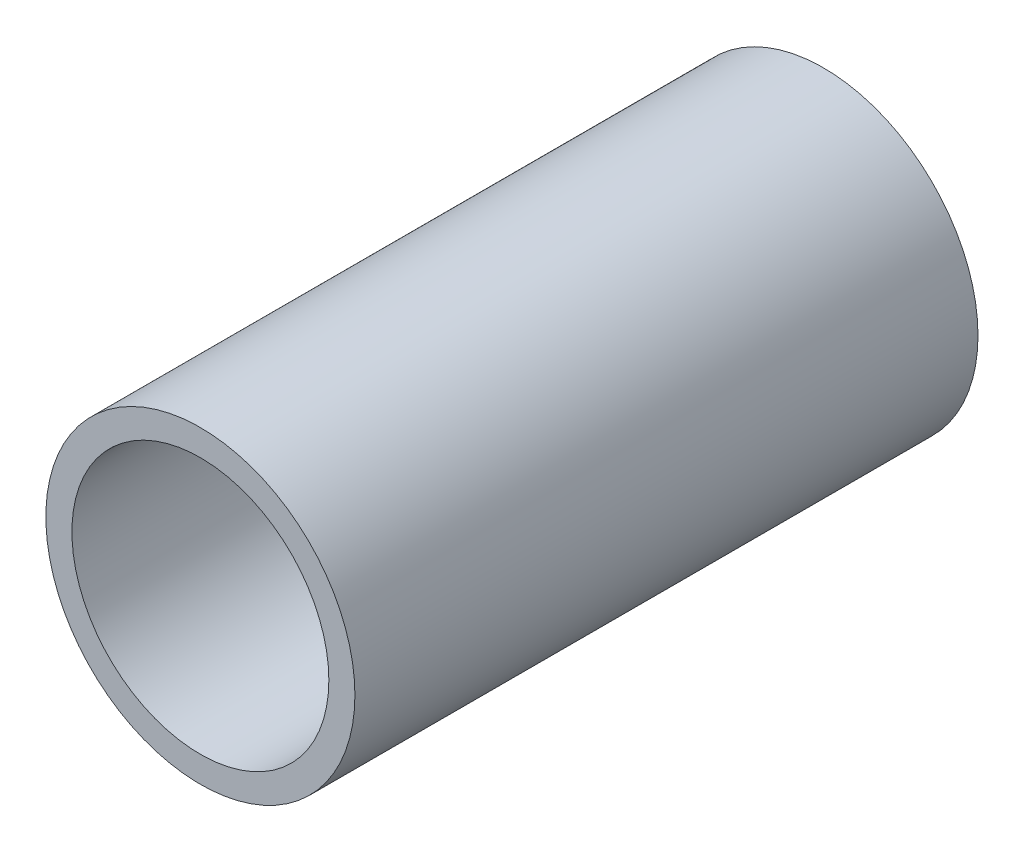
ISO-10303-21;
HEADER;
FILE_DESCRIPTION(('STEP AP214'),'2;1');
FILE_NAME('part.step','',(''),(''),'','','');
FILE_SCHEMA(('AUTOMOTIVE_DESIGN { 1 0 10303 214 1 1 1 1 }'));
ENDSEC;
DATA;
#1=APPLICATION_CONTEXT('core data for automotive mechanical design processes');
#2=APPLICATION_PROTOCOL_DEFINITION('international standard','automotive_design',2000,#1);
#3=PRODUCT_CONTEXT('',#1,'mechanical');
#4=PRODUCT('Part','Part','',(#3));
#5=PRODUCT_RELATED_PRODUCT_CATEGORY('part','',(#4));
#6=PRODUCT_DEFINITION_FORMATION('','',#4);
#7=PRODUCT_DEFINITION_CONTEXT('part definition',#1,'design');
#8=PRODUCT_DEFINITION('design','',#6,#7);
#9=PRODUCT_DEFINITION_SHAPE('','',#8);
#10=(LENGTH_UNIT() NAMED_UNIT(*) SI_UNIT(.MILLI.,.METRE.));
#11=(NAMED_UNIT(*) PLANE_ANGLE_UNIT() SI_UNIT($,.RADIAN.));
#12=(NAMED_UNIT(*) SI_UNIT($,.STERADIAN.) SOLID_ANGLE_UNIT());
#13=UNCERTAINTY_MEASURE_WITH_UNIT(LENGTH_MEASURE(1.E-05),#10,'distance_accuracy_value','');
#14=(GEOMETRIC_REPRESENTATION_CONTEXT(3) GLOBAL_UNCERTAINTY_ASSIGNED_CONTEXT((#13)) GLOBAL_UNIT_ASSIGNED_CONTEXT((#10,
#11,#12)) REPRESENTATION_CONTEXT('',''));
#15=CARTESIAN_POINT('',(0.,0.,0.));
#16=DIRECTION('',(0.,0.,1.));
#17=DIRECTION('',(1.,0.,0.));
#18=AXIS2_PLACEMENT_3D('',#15,#16,#17);
#19=CARTESIAN_POINT('',(0.,0.,42.5));
#20=DIRECTION('',(0.,0.,1.));
#21=DIRECTION('',(1.,0.,0.));
#22=AXIS2_PLACEMENT_3D('',#19,#20,#21);
#23=PLANE('',#22);
#24=CARTESIAN_POINT('',(0.,0.,42.5));
#25=DIRECTION('',(0.,0.,1.));
#26=DIRECTION('',(1.,0.,0.));
#27=AXIS2_PLACEMENT_3D('',#24,#25,#26);
#28=CIRCLE('',#27,21.082);
#29=CARTESIAN_POINT('',(21.082,0.,42.5));
#30=VERTEX_POINT('',#29);
#31=EDGE_CURVE('E11',#30,#30,#28,.T.);
#32=ORIENTED_EDGE('',*,*,#31,.T.);
#33=EDGE_LOOP('',(#32));
#34=FACE_BOUND('',#33,.T.);
#35=CARTESIAN_POINT('',(0.,0.,42.5));
#36=DIRECTION('',(0.,0.,1.));
#37=DIRECTION('',(1.,0.,0.));
#38=AXIS2_PLACEMENT_3D('',#35,#36,#37);
#39=CIRCLE('',#38,17.526);
#40=CARTESIAN_POINT('',(17.526,0.,42.5));
#41=VERTEX_POINT('',#40);
#42=EDGE_CURVE('E50',#41,#41,#39,.T.);
#43=ORIENTED_EDGE('',*,*,#42,.F.);
#44=EDGE_LOOP('',(#43));
#45=FACE_BOUND('',#44,.T.);
#46=ADVANCED_FACE('F39',(#34,#45),#23,.T.);
#47=CARTESIAN_POINT('',(0.,0.,-42.5));
#48=DIRECTION('',(0.,0.,1.));
#49=DIRECTION('',(1.,0.,0.));
#50=AXIS2_PLACEMENT_3D('',#47,#48,#49);
#51=PLANE('',#50);
#52=CARTESIAN_POINT('',(0.,0.,-42.5));
#53=DIRECTION('',(0.,0.,1.));
#54=DIRECTION('',(1.,0.,0.));
#55=AXIS2_PLACEMENT_3D('',#52,#53,#54);
#56=CIRCLE('',#55,21.082);
#57=CARTESIAN_POINT('',(21.082,0.,-42.5));
#58=VERTEX_POINT('',#57);
#59=EDGE_CURVE('E43',#58,#58,#56,.T.);
#60=ORIENTED_EDGE('',*,*,#59,.F.);
#61=EDGE_LOOP('',(#60));
#62=FACE_BOUND('',#61,.T.);
#63=CARTESIAN_POINT('',(0.,0.,-42.5));
#64=DIRECTION('',(0.,0.,1.));
#65=DIRECTION('',(1.,0.,0.));
#66=AXIS2_PLACEMENT_3D('',#63,#64,#65);
#67=CIRCLE('',#66,17.526);
#68=CARTESIAN_POINT('',(17.526,0.,-42.5));
#69=VERTEX_POINT('',#68);
#70=EDGE_CURVE('E52',#69,#69,#67,.T.);
#71=ORIENTED_EDGE('',*,*,#70,.T.);
#72=EDGE_LOOP('',(#71));
#73=FACE_BOUND('',#72,.T.);
#74=ADVANCED_FACE('F62',(#62,#73),#51,.F.);
#75=CARTESIAN_POINT('',(0.,0.,42.5));
#76=DIRECTION('',(0.,0.,-1.));
#77=DIRECTION('',(-1.,0.,0.));
#78=AXIS2_PLACEMENT_3D('',#75,#76,#77);
#79=CYLINDRICAL_SURFACE('',#78,21.082);
#80=ORIENTED_EDGE('',*,*,#31,.F.);
#81=EDGE_LOOP('',(#80));
#82=FACE_BOUND('',#81,.T.);
#83=ORIENTED_EDGE('',*,*,#59,.T.);
#84=EDGE_LOOP('',(#83));
#85=FACE_BOUND('',#84,.T.);
#86=ADVANCED_FACE('F41',(#82,#85),#79,.T.);
#87=CARTESIAN_POINT('',(0.,0.,42.5));
#88=DIRECTION('',(0.,0.,-1.));
#89=DIRECTION('',(-1.,0.,0.));
#90=AXIS2_PLACEMENT_3D('',#87,#88,#89);
#91=CYLINDRICAL_SURFACE('',#90,17.526);
#92=ORIENTED_EDGE('',*,*,#42,.T.);
#93=EDGE_LOOP('',(#92));
#94=FACE_BOUND('',#93,.T.);
#95=ORIENTED_EDGE('',*,*,#70,.F.);
#96=EDGE_LOOP('',(#95));
#97=FACE_BOUND('',#96,.T.);
#98=ADVANCED_FACE('F58',(#94,#97),#91,.F.);
#99=CLOSED_SHELL('',(#46,#74,#86,#98));
#100=MANIFOLD_SOLID_BREP('B2',#99);
#101=ADVANCED_BREP_SHAPE_REPRESENTATION('',(#18,#100),#14);
#102=SHAPE_DEFINITION_REPRESENTATION(#9,#101);
ENDSEC;
END-ISO-10303-21;
